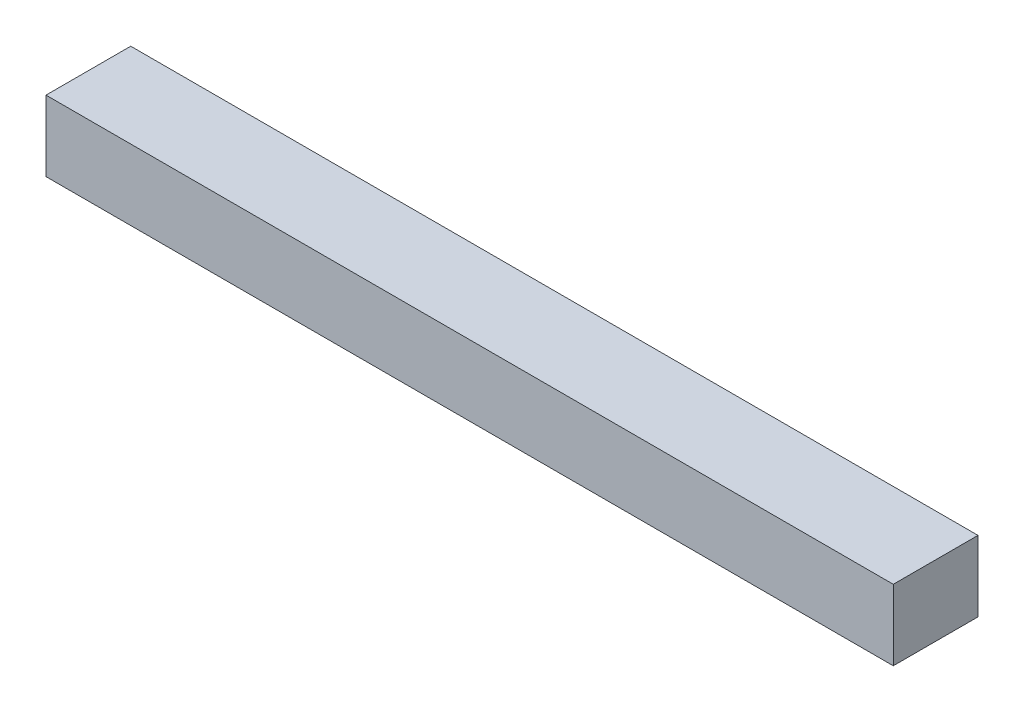
ISO-10303-21;
HEADER;
FILE_DESCRIPTION(('STEP AP214'),'2;1');
FILE_NAME('part.step','',(''),(''),'','','');
FILE_SCHEMA(('AUTOMOTIVE_DESIGN { 1 0 10303 214 1 1 1 1 }'));
ENDSEC;
DATA;
#1=APPLICATION_CONTEXT('core data for automotive mechanical design processes');
#2=APPLICATION_PROTOCOL_DEFINITION('international standard','automotive_design',2000,#1);
#3=PRODUCT_CONTEXT('',#1,'mechanical');
#4=PRODUCT('Part','Part','',(#3));
#5=PRODUCT_RELATED_PRODUCT_CATEGORY('part','',(#4));
#6=PRODUCT_DEFINITION_FORMATION('','',#4);
#7=PRODUCT_DEFINITION_CONTEXT('part definition',#1,'design');
#8=PRODUCT_DEFINITION('design','',#6,#7);
#9=PRODUCT_DEFINITION_SHAPE('','',#8);
#10=(LENGTH_UNIT() NAMED_UNIT(*) SI_UNIT(.MILLI.,.METRE.));
#11=(NAMED_UNIT(*) PLANE_ANGLE_UNIT() SI_UNIT($,.RADIAN.));
#12=(NAMED_UNIT(*) SI_UNIT($,.STERADIAN.) SOLID_ANGLE_UNIT());
#13=UNCERTAINTY_MEASURE_WITH_UNIT(LENGTH_MEASURE(1.E-05),#10,'distance_accuracy_value','');
#14=(GEOMETRIC_REPRESENTATION_CONTEXT(3) GLOBAL_UNCERTAINTY_ASSIGNED_CONTEXT((#13)) GLOBAL_UNIT_ASSIGNED_CONTEXT((#10,
#11,#12)) REPRESENTATION_CONTEXT('',''));
#15=CARTESIAN_POINT('',(0.,0.,0.));
#16=DIRECTION('',(0.,0.,1.));
#17=DIRECTION('',(1.,0.,0.));
#18=AXIS2_PLACEMENT_3D('',#15,#16,#17);
#19=CARTESIAN_POINT('',(300.,-12.5,-15.));
#20=DIRECTION('',(0.,0.,1.));
#21=DIRECTION('',(1.,0.,0.));
#22=AXIS2_PLACEMENT_3D('',#19,#20,#21);
#23=PLANE('',#22);
#24=DIRECTION('',(0.,1.,0.));
#25=VECTOR('',#24,1.);
#26=CARTESIAN_POINT('',(0.,-12.5,-15.));
#27=LINE('',#26,#25);
#28=CARTESIAN_POINT('',(0.,-12.5,-15.));
#29=VERTEX_POINT('',#28);
#30=CARTESIAN_POINT('',(0.,12.5,-15.));
#31=VERTEX_POINT('',#30);
#32=EDGE_CURVE('E99',#29,#31,#27,.T.);
#33=ORIENTED_EDGE('',*,*,#32,.T.);
#34=DIRECTION('',(-1.,0.,0.));
#35=VECTOR('',#34,1.);
#36=CARTESIAN_POINT('',(300.,12.5,-15.));
#37=LINE('',#36,#35);
#38=CARTESIAN_POINT('',(300.,12.5,-15.));
#39=VERTEX_POINT('',#38);
#40=EDGE_CURVE('E11',#39,#31,#37,.T.);
#41=ORIENTED_EDGE('',*,*,#40,.F.);
#42=DIRECTION('',(0.,1.,0.));
#43=VECTOR('',#42,1.);
#44=CARTESIAN_POINT('',(300.,-12.5,-15.));
#45=LINE('',#44,#43);
#46=CARTESIAN_POINT('',(300.,-12.5,-15.));
#47=VERTEX_POINT('',#46);
#48=EDGE_CURVE('E87',#47,#39,#45,.T.);
#49=ORIENTED_EDGE('',*,*,#48,.F.);
#50=DIRECTION('',(-1.,0.,0.));
#51=VECTOR('',#50,1.);
#52=CARTESIAN_POINT('',(300.,-12.5,-15.));
#53=LINE('',#52,#51);
#54=EDGE_CURVE('E95',#47,#29,#53,.T.);
#55=ORIENTED_EDGE('',*,*,#54,.T.);
#56=EDGE_LOOP('',(#33,#41,#49,#55));
#57=FACE_BOUND('',#56,.T.);
#58=ADVANCED_FACE('F36',(#57),#23,.F.);
#59=CARTESIAN_POINT('',(300.,12.5,15.));
#60=DIRECTION('',(0.,-1.,0.));
#61=DIRECTION('',(0.,0.,-1.));
#62=AXIS2_PLACEMENT_3D('',#59,#60,#61);
#63=PLANE('',#62);
#64=DIRECTION('',(0.,0.,1.));
#65=VECTOR('',#64,1.);
#66=CARTESIAN_POINT('',(0.,12.5,15.));
#67=LINE('',#66,#65);
#68=CARTESIAN_POINT('',(0.,12.5,15.));
#69=VERTEX_POINT('',#68);
#70=EDGE_CURVE('E91',#31,#69,#67,.T.);
#71=ORIENTED_EDGE('',*,*,#70,.T.);
#72=DIRECTION('',(-1.,0.,0.));
#73=VECTOR('',#72,1.);
#74=CARTESIAN_POINT('',(300.,12.5,15.));
#75=LINE('',#74,#73);
#76=CARTESIAN_POINT('',(300.,12.5,15.));
#77=VERTEX_POINT('',#76);
#78=EDGE_CURVE('E44',#77,#69,#75,.T.);
#79=ORIENTED_EDGE('',*,*,#78,.F.);
#80=DIRECTION('',(0.,0.,1.));
#81=VECTOR('',#80,1.);
#82=CARTESIAN_POINT('',(300.,12.5,15.));
#83=LINE('',#82,#81);
#84=EDGE_CURVE('E82',#39,#77,#83,.T.);
#85=ORIENTED_EDGE('',*,*,#84,.F.);
#86=ORIENTED_EDGE('',*,*,#40,.T.);
#87=EDGE_LOOP('',(#71,#79,#85,#86));
#88=FACE_BOUND('',#87,.T.);
#89=ADVANCED_FACE('F90',(#88),#63,.F.);
#90=CARTESIAN_POINT('',(300.,-12.5,15.));
#91=DIRECTION('',(0.,0.,-1.));
#92=DIRECTION('',(-1.,0.,0.));
#93=AXIS2_PLACEMENT_3D('',#90,#91,#92);
#94=PLANE('',#93);
#95=DIRECTION('',(0.,-1.,0.));
#96=VECTOR('',#95,1.);
#97=CARTESIAN_POINT('',(0.,-12.5,15.));
#98=LINE('',#97,#96);
#99=CARTESIAN_POINT('',(0.,-12.5,15.));
#100=VERTEX_POINT('',#99);
#101=EDGE_CURVE('E69',#69,#100,#98,.T.);
#102=ORIENTED_EDGE('',*,*,#101,.T.);
#103=DIRECTION('',(-1.,0.,0.));
#104=VECTOR('',#103,1.);
#105=CARTESIAN_POINT('',(300.,-12.5,15.));
#106=LINE('',#105,#104);
#107=CARTESIAN_POINT('',(300.,-12.5,15.));
#108=VERTEX_POINT('',#107);
#109=EDGE_CURVE('E92',#108,#100,#106,.T.);
#110=ORIENTED_EDGE('',*,*,#109,.F.);
#111=DIRECTION('',(0.,-1.,0.));
#112=VECTOR('',#111,1.);
#113=CARTESIAN_POINT('',(300.,-12.5,15.));
#114=LINE('',#113,#112);
#115=EDGE_CURVE('E85',#77,#108,#114,.T.);
#116=ORIENTED_EDGE('',*,*,#115,.F.);
#117=ORIENTED_EDGE('',*,*,#78,.T.);
#118=EDGE_LOOP('',(#102,#110,#116,#117));
#119=FACE_BOUND('',#118,.T.);
#120=ADVANCED_FACE('F93',(#119),#94,.F.);
#121=CARTESIAN_POINT('',(300.,-12.5,15.));
#122=DIRECTION('',(0.,1.,0.));
#123=DIRECTION('',(0.,0.,1.));
#124=AXIS2_PLACEMENT_3D('',#121,#122,#123);
#125=PLANE('',#124);
#126=DIRECTION('',(0.,0.,-1.));
#127=VECTOR('',#126,1.);
#128=CARTESIAN_POINT('',(0.,-12.5,15.));
#129=LINE('',#128,#127);
#130=EDGE_CURVE('E75',#100,#29,#129,.T.);
#131=ORIENTED_EDGE('',*,*,#130,.T.);
#132=ORIENTED_EDGE('',*,*,#54,.F.);
#133=DIRECTION('',(0.,0.,-1.));
#134=VECTOR('',#133,1.);
#135=CARTESIAN_POINT('',(300.,-12.5,15.));
#136=LINE('',#135,#134);
#137=EDGE_CURVE('E52',#108,#47,#136,.T.);
#138=ORIENTED_EDGE('',*,*,#137,.F.);
#139=ORIENTED_EDGE('',*,*,#109,.T.);
#140=EDGE_LOOP('',(#131,#132,#138,#139));
#141=FACE_BOUND('',#140,.T.);
#142=ADVANCED_FACE('F106',(#141),#125,.F.);
#143=CARTESIAN_POINT('',(300.,0.,0.));
#144=DIRECTION('',(-1.,0.,0.));
#145=DIRECTION('',(0.,0.,1.));
#146=AXIS2_PLACEMENT_3D('',#143,#144,#145);
#147=PLANE('',#146);
#148=ORIENTED_EDGE('',*,*,#48,.T.);
#149=ORIENTED_EDGE('',*,*,#84,.T.);
#150=ORIENTED_EDGE('',*,*,#115,.T.);
#151=ORIENTED_EDGE('',*,*,#137,.T.);
#152=EDGE_LOOP('',(#148,#149,#150,#151));
#153=FACE_BOUND('',#152,.T.);
#154=ADVANCED_FACE('F83',(#153),#147,.F.);
#155=CARTESIAN_POINT('',(0.,0.,0.));
#156=DIRECTION('',(-1.,0.,0.));
#157=DIRECTION('',(0.,0.,1.));
#158=AXIS2_PLACEMENT_3D('',#155,#156,#157);
#159=PLANE('',#158);
#160=ORIENTED_EDGE('',*,*,#32,.F.);
#161=ORIENTED_EDGE('',*,*,#130,.F.);
#162=ORIENTED_EDGE('',*,*,#101,.F.);
#163=ORIENTED_EDGE('',*,*,#70,.F.);
#164=EDGE_LOOP('',(#160,#161,#162,#163));
#165=FACE_BOUND('',#164,.T.);
#166=ADVANCED_FACE('F109',(#165),#159,.T.);
#167=CLOSED_SHELL('',(#58,#89,#120,#142,#154,#166));
#168=MANIFOLD_SOLID_BREP('B2',#167);
#169=ADVANCED_BREP_SHAPE_REPRESENTATION('',(#18,#168),#14);
#170=SHAPE_DEFINITION_REPRESENTATION(#9,#169);
ENDSEC;
END-ISO-10303-21;
